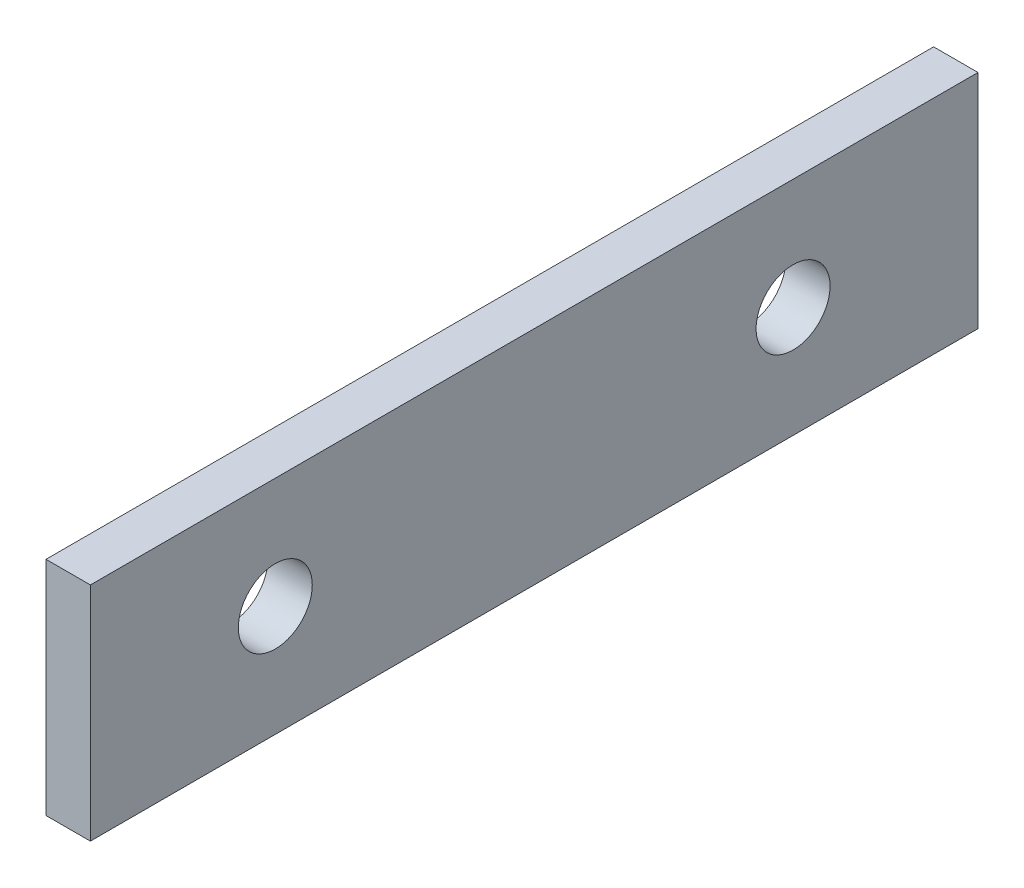
ISO-10303-21;
HEADER;
FILE_DESCRIPTION(('STEP AP214'),'2;1');
FILE_NAME('part.step','',(''),(''),'','','');
FILE_SCHEMA(('AUTOMOTIVE_DESIGN { 1 0 10303 214 1 1 1 1 }'));
ENDSEC;
DATA;
#1=APPLICATION_CONTEXT('core data for automotive mechanical design processes');
#2=APPLICATION_PROTOCOL_DEFINITION('international standard','automotive_design',2000,#1);
#3=PRODUCT_CONTEXT('',#1,'mechanical');
#4=PRODUCT('Part','Part','',(#3));
#5=PRODUCT_RELATED_PRODUCT_CATEGORY('part','',(#4));
#6=PRODUCT_DEFINITION_FORMATION('','',#4);
#7=PRODUCT_DEFINITION_CONTEXT('part definition',#1,'design');
#8=PRODUCT_DEFINITION('design','',#6,#7);
#9=PRODUCT_DEFINITION_SHAPE('','',#8);
#10=(LENGTH_UNIT() NAMED_UNIT(*) SI_UNIT(.MILLI.,.METRE.));
#11=(NAMED_UNIT(*) PLANE_ANGLE_UNIT() SI_UNIT($,.RADIAN.));
#12=(NAMED_UNIT(*) SI_UNIT($,.STERADIAN.) SOLID_ANGLE_UNIT());
#13=UNCERTAINTY_MEASURE_WITH_UNIT(LENGTH_MEASURE(1.E-05),#10,'distance_accuracy_value','');
#14=(GEOMETRIC_REPRESENTATION_CONTEXT(3) GLOBAL_UNCERTAINTY_ASSIGNED_CONTEXT((#13)) GLOBAL_UNIT_ASSIGNED_CONTEXT((#10,
#11,#12)) REPRESENTATION_CONTEXT('',''));
#15=CARTESIAN_POINT('',(0.,0.,0.));
#16=DIRECTION('',(0.,0.,1.));
#17=DIRECTION('',(1.,0.,0.));
#18=AXIS2_PLACEMENT_3D('',#15,#16,#17);
#19=CARTESIAN_POINT('',(3.,0.,-30.));
#20=DIRECTION('',(0.,0.,-1.));
#21=DIRECTION('',(-1.,0.,0.));
#22=AXIS2_PLACEMENT_3D('',#19,#20,#21);
#23=PLANE('',#22);
#24=DIRECTION('',(0.,-1.,0.));
#25=VECTOR('',#24,1.);
#26=CARTESIAN_POINT('',(0.,0.,-30.));
#27=LINE('',#26,#25);
#28=CARTESIAN_POINT('',(0.,0.,-30.));
#29=VERTEX_POINT('',#28);
#30=CARTESIAN_POINT('',(0.,-15.,-30.));
#31=VERTEX_POINT('',#30);
#32=EDGE_CURVE('E109',#29,#31,#27,.T.);
#33=ORIENTED_EDGE('',*,*,#32,.F.);
#34=DIRECTION('',(-1.,0.,0.));
#35=VECTOR('',#34,1.);
#36=CARTESIAN_POINT('',(3.,0.,-30.));
#37=LINE('',#36,#35);
#38=CARTESIAN_POINT('',(3.,0.,-30.));
#39=VERTEX_POINT('',#38);
#40=EDGE_CURVE('E11',#39,#29,#37,.T.);
#41=ORIENTED_EDGE('',*,*,#40,.F.);
#42=DIRECTION('',(0.,-1.,0.));
#43=VECTOR('',#42,1.);
#44=CARTESIAN_POINT('',(3.,0.,-30.));
#45=LINE('',#44,#43);
#46=CARTESIAN_POINT('',(3.,-15.,-30.));
#47=VERTEX_POINT('',#46);
#48=EDGE_CURVE('E96',#39,#47,#45,.T.);
#49=ORIENTED_EDGE('',*,*,#48,.T.);
#50=DIRECTION('',(-1.,0.,0.));
#51=VECTOR('',#50,1.);
#52=CARTESIAN_POINT('',(3.,-15.,-30.));
#53=LINE('',#52,#51);
#54=EDGE_CURVE('E75',#47,#31,#53,.T.);
#55=ORIENTED_EDGE('',*,*,#54,.T.);
#56=EDGE_LOOP('',(#33,#41,#49,#55));
#57=FACE_BOUND('',#56,.T.);
#58=ADVANCED_FACE('F35',(#57),#23,.T.);
#59=CARTESIAN_POINT('',(3.,0.,0.));
#60=DIRECTION('',(0.,1.,0.));
#61=DIRECTION('',(0.,0.,1.));
#62=AXIS2_PLACEMENT_3D('',#59,#60,#61);
#63=PLANE('',#62);
#64=DIRECTION('',(0.,0.,-1.));
#65=VECTOR('',#64,1.);
#66=CARTESIAN_POINT('',(0.,0.,0.));
#67=LINE('',#66,#65);
#68=CARTESIAN_POINT('',(0.,0.,30.));
#69=VERTEX_POINT('',#68);
#70=EDGE_CURVE('E87',#69,#29,#67,.T.);
#71=ORIENTED_EDGE('',*,*,#70,.F.);
#72=DIRECTION('',(-1.,0.,0.));
#73=VECTOR('',#72,1.);
#74=CARTESIAN_POINT('',(3.,0.,30.));
#75=LINE('',#74,#73);
#76=CARTESIAN_POINT('',(3.,0.,30.));
#77=VERTEX_POINT('',#76);
#78=EDGE_CURVE('E44',#77,#69,#75,.T.);
#79=ORIENTED_EDGE('',*,*,#78,.F.);
#80=DIRECTION('',(0.,0.,-1.));
#81=VECTOR('',#80,1.);
#82=CARTESIAN_POINT('',(3.,0.,0.));
#83=LINE('',#82,#81);
#84=EDGE_CURVE('E85',#77,#39,#83,.T.);
#85=ORIENTED_EDGE('',*,*,#84,.T.);
#86=ORIENTED_EDGE('',*,*,#40,.T.);
#87=EDGE_LOOP('',(#71,#79,#85,#86));
#88=FACE_BOUND('',#87,.T.);
#89=ADVANCED_FACE('F83',(#88),#63,.T.);
#90=CARTESIAN_POINT('',(3.,0.,30.));
#91=DIRECTION('',(0.,0.,-1.));
#92=DIRECTION('',(0.,1.,0.));
#93=AXIS2_PLACEMENT_3D('',#90,#91,#92);
#94=PLANE('',#93);
#95=DIRECTION('',(0.,-1.,0.));
#96=VECTOR('',#95,1.);
#97=CARTESIAN_POINT('',(0.,0.,30.));
#98=LINE('',#97,#96);
#99=CARTESIAN_POINT('',(0.,-15.,30.));
#100=VERTEX_POINT('',#99);
#101=EDGE_CURVE('E112',#69,#100,#98,.T.);
#102=ORIENTED_EDGE('',*,*,#101,.T.);
#103=DIRECTION('',(-1.,0.,0.));
#104=VECTOR('',#103,1.);
#105=CARTESIAN_POINT('',(3.,-15.,30.));
#106=LINE('',#105,#104);
#107=CARTESIAN_POINT('',(3.,-15.,30.));
#108=VERTEX_POINT('',#107);
#109=EDGE_CURVE('E90',#108,#100,#106,.T.);
#110=ORIENTED_EDGE('',*,*,#109,.F.);
#111=DIRECTION('',(0.,-1.,0.));
#112=VECTOR('',#111,1.);
#113=CARTESIAN_POINT('',(3.,0.,30.));
#114=LINE('',#113,#112);
#115=EDGE_CURVE('E92',#77,#108,#114,.T.);
#116=ORIENTED_EDGE('',*,*,#115,.F.);
#117=ORIENTED_EDGE('',*,*,#78,.T.);
#118=EDGE_LOOP('',(#102,#110,#116,#117));
#119=FACE_BOUND('',#118,.T.);
#120=ADVANCED_FACE('F93',(#119),#94,.F.);
#121=CARTESIAN_POINT('',(3.,-7.5,17.5));
#122=DIRECTION('',(-1.,0.,0.));
#123=DIRECTION('',(0.,0.,1.));
#124=AXIS2_PLACEMENT_3D('',#121,#122,#123);
#125=CYLINDRICAL_SURFACE('',#124,2.5);
#126=CARTESIAN_POINT('',(3.,-7.5,17.5));
#127=DIRECTION('',(1.,0.,0.));
#128=DIRECTION('',(0.,0.,-1.));
#129=AXIS2_PLACEMENT_3D('',#126,#127,#128);
#130=CIRCLE('',#129,2.5);
#131=CARTESIAN_POINT('',(3.,-7.5,15.));
#132=VERTEX_POINT('',#131);
#133=EDGE_CURVE('E98',#132,#132,#130,.T.);
#134=ORIENTED_EDGE('',*,*,#133,.T.);
#135=EDGE_LOOP('',(#134));
#136=FACE_BOUND('',#135,.T.);
#137=CARTESIAN_POINT('',(0.,-7.5,17.5));
#138=DIRECTION('',(1.,0.,0.));
#139=DIRECTION('',(0.,0.,-1.));
#140=AXIS2_PLACEMENT_3D('',#137,#138,#139);
#141=CIRCLE('',#140,2.5);
#142=CARTESIAN_POINT('',(0.,-7.5,15.));
#143=VERTEX_POINT('',#142);
#144=EDGE_CURVE('E106',#143,#143,#141,.T.);
#145=ORIENTED_EDGE('',*,*,#144,.F.);
#146=EDGE_LOOP('',(#145));
#147=FACE_BOUND('',#146,.T.);
#148=ADVANCED_FACE('F127',(#136,#147),#125,.F.);
#149=CARTESIAN_POINT('',(3.,-7.5,-17.5));
#150=DIRECTION('',(-1.,0.,0.));
#151=DIRECTION('',(0.,0.,1.));
#152=AXIS2_PLACEMENT_3D('',#149,#150,#151);
#153=CYLINDRICAL_SURFACE('',#152,2.5);
#154=CARTESIAN_POINT('',(3.,-7.5,-17.5));
#155=DIRECTION('',(1.,0.,0.));
#156=DIRECTION('',(0.,0.,-1.));
#157=AXIS2_PLACEMENT_3D('',#154,#155,#156);
#158=CIRCLE('',#157,2.5);
#159=CARTESIAN_POINT('',(3.,-7.5,-20.));
#160=VERTEX_POINT('',#159);
#161=EDGE_CURVE('E115',#160,#160,#158,.T.);
#162=ORIENTED_EDGE('',*,*,#161,.T.);
#163=EDGE_LOOP('',(#162));
#164=FACE_BOUND('',#163,.T.);
#165=CARTESIAN_POINT('',(0.,-7.5,-17.5));
#166=DIRECTION('',(1.,0.,0.));
#167=DIRECTION('',(0.,0.,-1.));
#168=AXIS2_PLACEMENT_3D('',#165,#166,#167);
#169=CIRCLE('',#168,2.5);
#170=CARTESIAN_POINT('',(0.,-7.5,-20.));
#171=VERTEX_POINT('',#170);
#172=EDGE_CURVE('E103',#171,#171,#169,.T.);
#173=ORIENTED_EDGE('',*,*,#172,.F.);
#174=EDGE_LOOP('',(#173));
#175=FACE_BOUND('',#174,.T.);
#176=ADVANCED_FACE('F37',(#164,#175),#153,.F.);
#177=CARTESIAN_POINT('',(3.,-15.,0.));
#178=DIRECTION('',(0.,1.,0.));
#179=DIRECTION('',(0.,0.,1.));
#180=AXIS2_PLACEMENT_3D('',#177,#178,#179);
#181=PLANE('',#180);
#182=DIRECTION('',(0.,0.,-1.));
#183=VECTOR('',#182,1.);
#184=CARTESIAN_POINT('',(0.,-15.,0.));
#185=LINE('',#184,#183);
#186=EDGE_CURVE('E68',#100,#31,#185,.T.);
#187=ORIENTED_EDGE('',*,*,#186,.T.);
#188=ORIENTED_EDGE('',*,*,#54,.F.);
#189=DIRECTION('',(0.,0.,-1.));
#190=VECTOR('',#189,1.);
#191=CARTESIAN_POINT('',(3.,-15.,0.));
#192=LINE('',#191,#190);
#193=EDGE_CURVE('E52',#108,#47,#192,.T.);
#194=ORIENTED_EDGE('',*,*,#193,.F.);
#195=ORIENTED_EDGE('',*,*,#109,.T.);
#196=EDGE_LOOP('',(#187,#188,#194,#195));
#197=FACE_BOUND('',#196,.T.);
#198=ADVANCED_FACE('F118',(#197),#181,.F.);
#199=CARTESIAN_POINT('',(3.,0.,0.));
#200=DIRECTION('',(1.,0.,0.));
#201=DIRECTION('',(0.,0.,-1.));
#202=AXIS2_PLACEMENT_3D('',#199,#200,#201);
#203=PLANE('',#202);
#204=ORIENTED_EDGE('',*,*,#161,.F.);
#205=EDGE_LOOP('',(#204));
#206=FACE_BOUND('',#205,.T.);
#207=ORIENTED_EDGE('',*,*,#133,.F.);
#208=EDGE_LOOP('',(#207));
#209=FACE_BOUND('',#208,.T.);
#210=ORIENTED_EDGE('',*,*,#48,.F.);
#211=ORIENTED_EDGE('',*,*,#84,.F.);
#212=ORIENTED_EDGE('',*,*,#115,.T.);
#213=ORIENTED_EDGE('',*,*,#193,.T.);
#214=EDGE_LOOP('',(#210,#211,#212,#213));
#215=FACE_BOUND('',#214,.T.);
#216=ADVANCED_FACE('F95',(#206,#209,#215),#203,.T.);
#217=CARTESIAN_POINT('',(0.,0.,0.));
#218=DIRECTION('',(1.,0.,0.));
#219=DIRECTION('',(0.,0.,-1.));
#220=AXIS2_PLACEMENT_3D('',#217,#218,#219);
#221=PLANE('',#220);
#222=ORIENTED_EDGE('',*,*,#172,.T.);
#223=EDGE_LOOP('',(#222));
#224=FACE_BOUND('',#223,.T.);
#225=ORIENTED_EDGE('',*,*,#144,.T.);
#226=EDGE_LOOP('',(#225));
#227=FACE_BOUND('',#226,.T.);
#228=ORIENTED_EDGE('',*,*,#32,.T.);
#229=ORIENTED_EDGE('',*,*,#186,.F.);
#230=ORIENTED_EDGE('',*,*,#101,.F.);
#231=ORIENTED_EDGE('',*,*,#70,.T.);
#232=EDGE_LOOP('',(#228,#229,#230,#231));
#233=FACE_BOUND('',#232,.T.);
#234=ADVANCED_FACE('F119',(#224,#227,#233),#221,.F.);
#235=CLOSED_SHELL('',(#58,#89,#120,#148,#176,#198,#216,#234));
#236=MANIFOLD_SOLID_BREP('B2',#235);
#237=ADVANCED_BREP_SHAPE_REPRESENTATION('',(#18,#236),#14);
#238=SHAPE_DEFINITION_REPRESENTATION(#9,#237);
ENDSEC;
END-ISO-10303-21;
